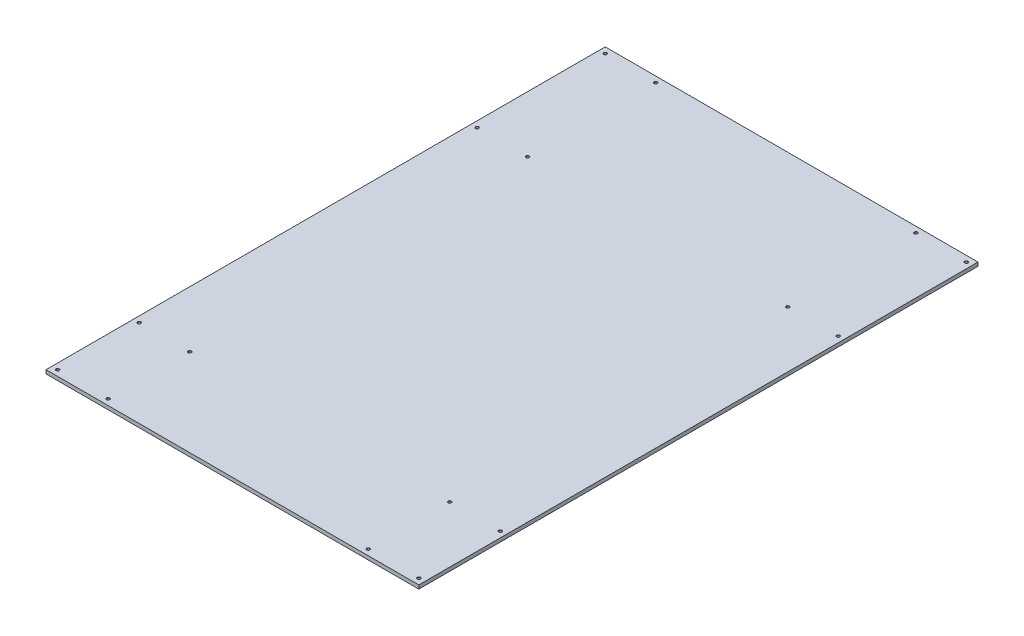
ISO-10303-21;
HEADER;
FILE_DESCRIPTION(('STEP AP214'),'2;1');
FILE_NAME('part.step','',(''),(''),'','','');
FILE_SCHEMA(('AUTOMOTIVE_DESIGN { 1 0 10303 214 1 1 1 1 }'));
ENDSEC;
DATA;
#1=APPLICATION_CONTEXT('core data for automotive mechanical design processes');
#2=APPLICATION_PROTOCOL_DEFINITION('international standard','automotive_design',2000,#1);
#3=PRODUCT_CONTEXT('',#1,'mechanical');
#4=PRODUCT('Part','Part','',(#3));
#5=PRODUCT_RELATED_PRODUCT_CATEGORY('part','',(#4));
#6=PRODUCT_DEFINITION_FORMATION('','',#4);
#7=PRODUCT_DEFINITION_CONTEXT('part definition',#1,'design');
#8=PRODUCT_DEFINITION('design','',#6,#7);
#9=PRODUCT_DEFINITION_SHAPE('','',#8);
#10=(LENGTH_UNIT() NAMED_UNIT(*) SI_UNIT(.MILLI.,.METRE.));
#11=(NAMED_UNIT(*) PLANE_ANGLE_UNIT() SI_UNIT($,.RADIAN.));
#12=(NAMED_UNIT(*) SI_UNIT($,.STERADIAN.) SOLID_ANGLE_UNIT());
#13=UNCERTAINTY_MEASURE_WITH_UNIT(LENGTH_MEASURE(1.E-05),#10,'distance_accuracy_value','');
#14=(GEOMETRIC_REPRESENTATION_CONTEXT(3) GLOBAL_UNCERTAINTY_ASSIGNED_CONTEXT((#13)) GLOBAL_UNIT_ASSIGNED_CONTEXT((#10,
#11,#12)) REPRESENTATION_CONTEXT('',''));
#15=CARTESIAN_POINT('',(0.,0.,0.));
#16=DIRECTION('',(0.,0.,1.));
#17=DIRECTION('',(1.,0.,0.));
#18=AXIS2_PLACEMENT_3D('',#15,#16,#17);
#19=CARTESIAN_POINT('',(0.,0.,0.));
#20=DIRECTION('',(0.,-1.,0.));
#21=DIRECTION('',(0.,0.,-1.));
#22=AXIS2_PLACEMENT_3D('',#19,#20,#21);
#23=PLANE('',#22);
#24=CARTESIAN_POINT('',(590.55,0.,-895.35));
#25=DIRECTION('',(0.,1.,0.));
#26=DIRECTION('',(0.,0.,1.));
#27=AXIS2_PLACEMENT_3D('',#24,#25,#26);
#28=CIRCLE('',#27,5.19912600000005);
#29=CARTESIAN_POINT('',(590.55,0.,-890.150874));
#30=VERTEX_POINT('',#29);
#31=EDGE_CURVE('E151',#30,#30,#28,.T.);
#32=ORIENTED_EDGE('',*,*,#31,.F.);
#33=EDGE_LOOP('',(#32));
#34=FACE_BOUND('',#33,.T.);
#35=CARTESIAN_POINT('',(425.45,0.,-895.35));
#36=DIRECTION('',(0.,1.,0.));
#37=DIRECTION('',(0.,0.,1.));
#38=AXIS2_PLACEMENT_3D('',#35,#36,#37);
#39=CIRCLE('',#38,5.199126);
#40=CARTESIAN_POINT('',(425.45,0.,-890.150874));
#41=VERTEX_POINT('',#40);
#42=EDGE_CURVE('E144',#41,#41,#39,.T.);
#43=ORIENTED_EDGE('',*,*,#42,.F.);
#44=EDGE_LOOP('',(#43));
#45=FACE_BOUND('',#44,.T.);
#46=CARTESIAN_POINT('',(590.55,0.,-476.25));
#47=DIRECTION('',(0.,1.,0.));
#48=DIRECTION('',(0.,0.,1.));
#49=AXIS2_PLACEMENT_3D('',#46,#47,#48);
#50=CIRCLE('',#49,5.19912600000005);
#51=CARTESIAN_POINT('',(590.55,0.,-471.050874));
#52=VERTEX_POINT('',#51);
#53=EDGE_CURVE('E169',#52,#52,#50,.T.);
#54=ORIENTED_EDGE('',*,*,#53,.F.);
#55=EDGE_LOOP('',(#54));
#56=FACE_BOUND('',#55,.T.);
#57=CARTESIAN_POINT('',(590.55,0.,628.65));
#58=DIRECTION('',(0.,1.,0.));
#59=DIRECTION('',(0.,0.,1.));
#60=AXIS2_PLACEMENT_3D('',#57,#58,#59);
#61=CIRCLE('',#60,5.19912600000005);
#62=CARTESIAN_POINT('',(590.55,0.,633.849126));
#63=VERTEX_POINT('',#62);
#64=EDGE_CURVE('E178',#63,#63,#61,.T.);
#65=ORIENTED_EDGE('',*,*,#64,.F.);
#66=EDGE_LOOP('',(#65));
#67=FACE_BOUND('',#66,.T.);
#68=CARTESIAN_POINT('',(425.45,0.,628.65));
#69=DIRECTION('',(0.,1.,0.));
#70=DIRECTION('',(0.,0.,1.));
#71=AXIS2_PLACEMENT_3D('',#68,#69,#70);
#72=CIRCLE('',#71,5.199126);
#73=CARTESIAN_POINT('',(425.45,0.,633.849126));
#74=VERTEX_POINT('',#73);
#75=EDGE_CURVE('E187',#74,#74,#72,.T.);
#76=ORIENTED_EDGE('',*,*,#75,.F.);
#77=EDGE_LOOP('',(#76));
#78=FACE_BOUND('',#77,.T.);
#79=CARTESIAN_POINT('',(425.45,0.,895.35));
#80=DIRECTION('',(0.,1.,0.));
#81=DIRECTION('',(0.,0.,1.));
#82=AXIS2_PLACEMENT_3D('',#79,#80,#81);
#83=CIRCLE('',#82,5.199126);
#84=CARTESIAN_POINT('',(425.45,0.,900.549126));
#85=VERTEX_POINT('',#84);
#86=EDGE_CURVE('E196',#85,#85,#83,.T.);
#87=ORIENTED_EDGE('',*,*,#86,.F.);
#88=EDGE_LOOP('',(#87));
#89=FACE_BOUND('',#88,.T.);
#90=CARTESIAN_POINT('',(590.55,0.,895.35));
#91=DIRECTION('',(0.,1.,0.));
#92=DIRECTION('',(0.,0.,1.));
#93=AXIS2_PLACEMENT_3D('',#90,#91,#92);
#94=CIRCLE('',#93,5.19912600000005);
#95=CARTESIAN_POINT('',(590.55,0.,900.549126));
#96=VERTEX_POINT('',#95);
#97=EDGE_CURVE('E205',#96,#96,#94,.T.);
#98=ORIENTED_EDGE('',*,*,#97,.F.);
#99=EDGE_LOOP('',(#98));
#100=FACE_BOUND('',#99,.T.);
#101=CARTESIAN_POINT('',(-590.55,0.,-895.35));
#102=DIRECTION('',(0.,1.,0.));
#103=DIRECTION('',(0.,0.,1.));
#104=AXIS2_PLACEMENT_3D('',#101,#102,#103);
#105=CIRCLE('',#104,5.19912600000005);
#106=CARTESIAN_POINT('',(-590.55,0.,-890.150874));
#107=VERTEX_POINT('',#106);
#108=EDGE_CURVE('E214',#107,#107,#105,.T.);
#109=ORIENTED_EDGE('',*,*,#108,.F.);
#110=EDGE_LOOP('',(#109));
#111=FACE_BOUND('',#110,.T.);
#112=CARTESIAN_POINT('',(-425.45,0.,-895.35));
#113=DIRECTION('',(0.,1.,0.));
#114=DIRECTION('',(0.,0.,1.));
#115=AXIS2_PLACEMENT_3D('',#112,#113,#114);
#116=CIRCLE('',#115,5.199126);
#117=CARTESIAN_POINT('',(-425.45,0.,-890.150874));
#118=VERTEX_POINT('',#117);
#119=EDGE_CURVE('E223',#118,#118,#116,.T.);
#120=ORIENTED_EDGE('',*,*,#119,.F.);
#121=EDGE_LOOP('',(#120));
#122=FACE_BOUND('',#121,.T.);
#123=CARTESIAN_POINT('',(-425.45,0.,-476.25));
#124=DIRECTION('',(0.,1.,0.));
#125=DIRECTION('',(0.,0.,1.));
#126=AXIS2_PLACEMENT_3D('',#123,#124,#125);
#127=CIRCLE('',#126,5.199126);
#128=CARTESIAN_POINT('',(-425.45,0.,-471.050874));
#129=VERTEX_POINT('',#128);
#130=EDGE_CURVE('E232',#129,#129,#127,.T.);
#131=ORIENTED_EDGE('',*,*,#130,.F.);
#132=EDGE_LOOP('',(#131));
#133=FACE_BOUND('',#132,.T.);
#134=CARTESIAN_POINT('',(-590.55,0.,-476.25));
#135=DIRECTION('',(0.,1.,0.));
#136=DIRECTION('',(0.,0.,1.));
#137=AXIS2_PLACEMENT_3D('',#134,#135,#136);
#138=CIRCLE('',#137,5.19912600000005);
#139=CARTESIAN_POINT('',(-590.55,0.,-471.050874));
#140=VERTEX_POINT('',#139);
#141=EDGE_CURVE('E241',#140,#140,#138,.T.);
#142=ORIENTED_EDGE('',*,*,#141,.F.);
#143=EDGE_LOOP('',(#142));
#144=FACE_BOUND('',#143,.T.);
#145=CARTESIAN_POINT('',(-590.55,0.,628.65));
#146=DIRECTION('',(0.,1.,0.));
#147=DIRECTION('',(0.,0.,1.));
#148=AXIS2_PLACEMENT_3D('',#145,#146,#147);
#149=CIRCLE('',#148,5.19912600000005);
#150=CARTESIAN_POINT('',(-590.55,0.,633.849126));
#151=VERTEX_POINT('',#150);
#152=EDGE_CURVE('E250',#151,#151,#149,.T.);
#153=ORIENTED_EDGE('',*,*,#152,.F.);
#154=EDGE_LOOP('',(#153));
#155=FACE_BOUND('',#154,.T.);
#156=CARTESIAN_POINT('',(-425.45,0.,895.35));
#157=DIRECTION('',(0.,1.,0.));
#158=DIRECTION('',(0.,0.,1.));
#159=AXIS2_PLACEMENT_3D('',#156,#157,#158);
#160=CIRCLE('',#159,5.199126);
#161=CARTESIAN_POINT('',(-425.45,0.,900.549126));
#162=VERTEX_POINT('',#161);
#163=EDGE_CURVE('E268',#162,#162,#160,.T.);
#164=ORIENTED_EDGE('',*,*,#163,.F.);
#165=EDGE_LOOP('',(#164));
#166=FACE_BOUND('',#165,.T.);
#167=CARTESIAN_POINT('',(-590.55,0.,895.35));
#168=DIRECTION('',(0.,1.,0.));
#169=DIRECTION('',(0.,0.,1.));
#170=AXIS2_PLACEMENT_3D('',#167,#168,#169);
#171=CIRCLE('',#170,5.19912600000005);
#172=CARTESIAN_POINT('',(-590.55,0.,900.549126));
#173=VERTEX_POINT('',#172);
#174=EDGE_CURVE('E277',#173,#173,#171,.T.);
#175=ORIENTED_EDGE('',*,*,#174,.F.);
#176=EDGE_LOOP('',(#175));
#177=FACE_BOUND('',#176,.T.);
#178=DIRECTION('',(0.,0.,-1.));
#179=VECTOR('',#178,1.);
#180=CARTESIAN_POINT('',(609.6,0.,914.4));
#181=LINE('',#180,#179);
#182=CARTESIAN_POINT('',(609.6,0.,914.4));
#183=VERTEX_POINT('',#182);
#184=CARTESIAN_POINT('',(609.6,0.,-914.4));
#185=VERTEX_POINT('',#184);
#186=EDGE_CURVE('E286',#183,#185,#181,.T.);
#187=ORIENTED_EDGE('',*,*,#186,.T.);
#188=DIRECTION('',(-1.,0.,0.));
#189=VECTOR('',#188,1.);
#190=CARTESIAN_POINT('',(-609.6,0.,-914.4));
#191=LINE('',#190,#189);
#192=CARTESIAN_POINT('',(-609.6,0.,-914.4));
#193=VERTEX_POINT('',#192);
#194=EDGE_CURVE('E298',#185,#193,#191,.T.);
#195=ORIENTED_EDGE('',*,*,#194,.T.);
#196=DIRECTION('',(0.,0.,1.));
#197=VECTOR('',#196,1.);
#198=CARTESIAN_POINT('',(-609.6,0.,914.4));
#199=LINE('',#198,#197);
#200=CARTESIAN_POINT('',(-609.6,0.,914.4));
#201=VERTEX_POINT('',#200);
#202=EDGE_CURVE('E301',#193,#201,#199,.T.);
#203=ORIENTED_EDGE('',*,*,#202,.T.);
#204=DIRECTION('',(1.,0.,0.));
#205=VECTOR('',#204,1.);
#206=CARTESIAN_POINT('',(-609.6,0.,914.4));
#207=LINE('',#206,#205);
#208=EDGE_CURVE('E290',#201,#183,#207,.T.);
#209=ORIENTED_EDGE('',*,*,#208,.T.);
#210=EDGE_LOOP('',(#187,#195,#203,#209));
#211=FACE_BOUND('',#210,.T.);
#212=CARTESIAN_POINT('',(-425.45,0.,628.65));
#213=DIRECTION('',(0.,1.,0.));
#214=DIRECTION('',(0.,0.,1.));
#215=AXIS2_PLACEMENT_3D('',#212,#213,#214);
#216=CIRCLE('',#215,5.199126);
#217=CARTESIAN_POINT('',(-425.45,0.,633.849126));
#218=VERTEX_POINT('',#217);
#219=EDGE_CURVE('E259',#218,#218,#216,.T.);
#220=ORIENTED_EDGE('',*,*,#219,.F.);
#221=EDGE_LOOP('',(#220));
#222=FACE_BOUND('',#221,.T.);
#223=CARTESIAN_POINT('',(425.45,0.,-476.25));
#224=DIRECTION('',(0.,1.,0.));
#225=DIRECTION('',(0.,0.,1.));
#226=AXIS2_PLACEMENT_3D('',#223,#224,#225);
#227=CIRCLE('',#226,5.199126);
#228=CARTESIAN_POINT('',(425.45,0.,-471.050874));
#229=VERTEX_POINT('',#228);
#230=EDGE_CURVE('E160',#229,#229,#227,.T.);
#231=ORIENTED_EDGE('',*,*,#230,.F.);
#232=EDGE_LOOP('',(#231));
#233=FACE_BOUND('',#232,.T.);
#234=ADVANCED_FACE('F39',(#34,#45,#56,#67,#78,#89,#100,#111,#122,#133,#144,#155,#166,#177,#211,
#222,#233),#23,.F.);
#235=CARTESIAN_POINT('',(609.6,-12.,914.4));
#236=DIRECTION('',(1.,0.,0.));
#237=DIRECTION('',(0.,0.,-1.));
#238=AXIS2_PLACEMENT_3D('',#235,#236,#237);
#239=PLANE('',#238);
#240=ORIENTED_EDGE('',*,*,#186,.F.);
#241=DIRECTION('',(0.,1.,0.));
#242=VECTOR('',#241,1.);
#243=CARTESIAN_POINT('',(609.6,-12.,914.4));
#244=LINE('',#243,#242);
#245=CARTESIAN_POINT('',(609.6,-12.,914.4));
#246=VERTEX_POINT('',#245);
#247=EDGE_CURVE('E11',#246,#183,#244,.T.);
#248=ORIENTED_EDGE('',*,*,#247,.F.);
#249=DIRECTION('',(0.,0.,-1.));
#250=VECTOR('',#249,1.);
#251=CARTESIAN_POINT('',(609.6,-12.,914.4));
#252=LINE('',#251,#250);
#253=CARTESIAN_POINT('',(609.6,-12.,-914.4));
#254=VERTEX_POINT('',#253);
#255=EDGE_CURVE('E287',#246,#254,#252,.T.);
#256=ORIENTED_EDGE('',*,*,#255,.T.);
#257=DIRECTION('',(0.,1.,0.));
#258=VECTOR('',#257,1.);
#259=CARTESIAN_POINT('',(609.6,-12.,-914.4));
#260=LINE('',#259,#258);
#261=EDGE_CURVE('E43',#254,#185,#260,.T.);
#262=ORIENTED_EDGE('',*,*,#261,.T.);
#263=EDGE_LOOP('',(#240,#248,#256,#262));
#264=FACE_BOUND('',#263,.T.);
#265=ADVANCED_FACE('F41',(#264),#239,.T.);
#266=CARTESIAN_POINT('',(-609.6,-12.,914.4));
#267=DIRECTION('',(0.,0.,1.));
#268=DIRECTION('',(1.,0.,0.));
#269=AXIS2_PLACEMENT_3D('',#266,#267,#268);
#270=PLANE('',#269);
#271=ORIENTED_EDGE('',*,*,#208,.F.);
#272=DIRECTION('',(0.,1.,0.));
#273=VECTOR('',#272,1.);
#274=CARTESIAN_POINT('',(-609.6,-12.,914.4));
#275=LINE('',#274,#273);
#276=CARTESIAN_POINT('',(-609.6,-12.,914.4));
#277=VERTEX_POINT('',#276);
#278=EDGE_CURVE('E49',#277,#201,#275,.T.);
#279=ORIENTED_EDGE('',*,*,#278,.F.);
#280=DIRECTION('',(1.,0.,0.));
#281=VECTOR('',#280,1.);
#282=CARTESIAN_POINT('',(-609.6,-12.,914.4));
#283=LINE('',#282,#281);
#284=EDGE_CURVE('E294',#277,#246,#283,.T.);
#285=ORIENTED_EDGE('',*,*,#284,.T.);
#286=ORIENTED_EDGE('',*,*,#247,.T.);
#287=EDGE_LOOP('',(#271,#279,#285,#286));
#288=FACE_BOUND('',#287,.T.);
#289=ADVANCED_FACE('F309',(#288),#270,.T.);
#290=CARTESIAN_POINT('',(-609.6,-12.,914.4));
#291=DIRECTION('',(-1.,0.,0.));
#292=DIRECTION('',(0.,0.,1.));
#293=AXIS2_PLACEMENT_3D('',#290,#291,#292);
#294=PLANE('',#293);
#295=ORIENTED_EDGE('',*,*,#202,.F.);
#296=DIRECTION('',(0.,1.,0.));
#297=VECTOR('',#296,1.);
#298=CARTESIAN_POINT('',(-609.6,-12.,-914.4));
#299=LINE('',#298,#297);
#300=CARTESIAN_POINT('',(-609.6,-12.,-914.4));
#301=VERTEX_POINT('',#300);
#302=EDGE_CURVE('E305',#301,#193,#299,.T.);
#303=ORIENTED_EDGE('',*,*,#302,.F.);
#304=DIRECTION('',(0.,0.,1.));
#305=VECTOR('',#304,1.);
#306=CARTESIAN_POINT('',(-609.6,-12.,914.4));
#307=LINE('',#306,#305);
#308=EDGE_CURVE('E292',#301,#277,#307,.T.);
#309=ORIENTED_EDGE('',*,*,#308,.T.);
#310=ORIENTED_EDGE('',*,*,#278,.T.);
#311=EDGE_LOOP('',(#295,#303,#309,#310));
#312=FACE_BOUND('',#311,.T.);
#313=ADVANCED_FACE('F312',(#312),#294,.T.);
#314=CARTESIAN_POINT('',(-609.6,-12.,-914.4));
#315=DIRECTION('',(0.,0.,-1.));
#316=DIRECTION('',(-1.,0.,0.));
#317=AXIS2_PLACEMENT_3D('',#314,#315,#316);
#318=PLANE('',#317);
#319=ORIENTED_EDGE('',*,*,#194,.F.);
#320=ORIENTED_EDGE('',*,*,#261,.F.);
#321=DIRECTION('',(-1.,0.,0.));
#322=VECTOR('',#321,1.);
#323=CARTESIAN_POINT('',(-609.6,-12.,-914.4));
#324=LINE('',#323,#322);
#325=EDGE_CURVE('E289',#254,#301,#324,.T.);
#326=ORIENTED_EDGE('',*,*,#325,.T.);
#327=ORIENTED_EDGE('',*,*,#302,.T.);
#328=EDGE_LOOP('',(#319,#320,#326,#327));
#329=FACE_BOUND('',#328,.T.);
#330=ADVANCED_FACE('F306',(#329),#318,.T.);
#331=CARTESIAN_POINT('',(0.,-12.,0.));
#332=DIRECTION('',(0.,-1.,0.));
#333=DIRECTION('',(0.,0.,-1.));
#334=AXIS2_PLACEMENT_3D('',#331,#332,#333);
#335=PLANE('',#334);
#336=ORIENTED_EDGE('',*,*,#255,.F.);
#337=ORIENTED_EDGE('',*,*,#284,.F.);
#338=ORIENTED_EDGE('',*,*,#308,.F.);
#339=ORIENTED_EDGE('',*,*,#325,.F.);
#340=EDGE_LOOP('',(#336,#337,#338,#339));
#341=FACE_BOUND('',#340,.T.);
#342=ADVANCED_FACE('F314',(#341),#335,.T.);
#343=CARTESIAN_POINT('',(-590.55,-7.17947142632021,895.35));
#344=DIRECTION('',(0.,1.,0.));
#345=DIRECTION('',(0.,0.,1.));
#346=AXIS2_PLACEMENT_3D('',#343,#344,#345);
#347=CONICAL_SURFACE('',#346,4.564126,1.02974425867665);
#348=CARTESIAN_POINT('',(-590.55,-9.921875,895.35));
#349=VERTEX_POINT('',#348);
#350=VERTEX_LOOP('',#349);
#351=FACE_BOUND('',#350,.T.);
#352=CARTESIAN_POINT('',(-590.55,-7.17947142632021,895.35));
#353=DIRECTION('',(0.,1.,0.));
#354=DIRECTION('',(0.,0.,1.));
#355=AXIS2_PLACEMENT_3D('',#352,#353,#354);
#356=CIRCLE('',#355,4.564126);
#357=CARTESIAN_POINT('',(-590.55,-7.17947142632021,899.914126));
#358=VERTEX_POINT('',#357);
#359=EDGE_CURVE('E283',#358,#358,#356,.T.);
#360=ORIENTED_EDGE('',*,*,#359,.T.);
#361=EDGE_LOOP('',(#360));
#362=FACE_BOUND('',#361,.T.);
#363=ADVANCED_FACE('F316',(#351,#362),#347,.F.);
#364=CARTESIAN_POINT('',(-590.55,0.,895.35));
#365=DIRECTION('',(0.,1.,0.));
#366=DIRECTION('',(0.,0.,1.));
#367=AXIS2_PLACEMENT_3D('',#364,#365,#366);
#368=CYLINDRICAL_SURFACE('',#367,4.564126);
#369=ORIENTED_EDGE('',*,*,#359,.F.);
#370=EDGE_LOOP('',(#369));
#371=FACE_BOUND('',#370,.T.);
#372=CARTESIAN_POINT('',(-590.55,-0.634999999999998,895.35));
#373=DIRECTION('',(0.,1.,0.));
#374=DIRECTION('',(0.,0.,1.));
#375=AXIS2_PLACEMENT_3D('',#372,#373,#374);
#376=CIRCLE('',#375,4.564126);
#377=CARTESIAN_POINT('',(-590.55,-0.634999999999998,899.914126));
#378=VERTEX_POINT('',#377);
#379=EDGE_CURVE('E280',#378,#378,#376,.T.);
#380=ORIENTED_EDGE('',*,*,#379,.T.);
#381=EDGE_LOOP('',(#380));
#382=FACE_BOUND('',#381,.T.);
#383=ADVANCED_FACE('F322',(#371,#382),#368,.F.);
#384=CARTESIAN_POINT('',(-590.55,0.,895.35));
#385=DIRECTION('',(0.,1.,0.));
#386=DIRECTION('',(0.,0.,1.));
#387=AXIS2_PLACEMENT_3D('',#384,#385,#386);
#388=CONICAL_SURFACE('',#387,5.19912600000005,0.785398163397491);
#389=ORIENTED_EDGE('',*,*,#379,.F.);
#390=EDGE_LOOP('',(#389));
#391=FACE_BOUND('',#390,.T.);
#392=ORIENTED_EDGE('',*,*,#174,.T.);
#393=EDGE_LOOP('',(#392));
#394=FACE_BOUND('',#393,.T.);
#395=ADVANCED_FACE('F368',(#391,#394),#388,.F.);
#396=CARTESIAN_POINT('',(-425.45,-7.17947142632021,895.35));
#397=DIRECTION('',(0.,1.,0.));
#398=DIRECTION('',(0.,0.,1.));
#399=AXIS2_PLACEMENT_3D('',#396,#397,#398);
#400=CONICAL_SURFACE('',#399,4.564126,1.02974425867665);
#401=CARTESIAN_POINT('',(-425.45,-9.921875,895.35));
#402=VERTEX_POINT('',#401);
#403=VERTEX_LOOP('',#402);
#404=FACE_BOUND('',#403,.T.);
#405=CARTESIAN_POINT('',(-425.45,-7.17947142632021,895.35));
#406=DIRECTION('',(0.,1.,0.));
#407=DIRECTION('',(0.,0.,1.));
#408=AXIS2_PLACEMENT_3D('',#405,#406,#407);
#409=CIRCLE('',#408,4.564126);
#410=CARTESIAN_POINT('',(-425.45,-7.17947142632021,899.914126));
#411=VERTEX_POINT('',#410);
#412=EDGE_CURVE('E274',#411,#411,#409,.T.);
#413=ORIENTED_EDGE('',*,*,#412,.T.);
#414=EDGE_LOOP('',(#413));
#415=FACE_BOUND('',#414,.T.);
#416=ADVANCED_FACE('F378',(#404,#415),#400,.F.);
#417=CARTESIAN_POINT('',(-425.45,0.,895.35));
#418=DIRECTION('',(0.,1.,0.));
#419=DIRECTION('',(0.,0.,1.));
#420=AXIS2_PLACEMENT_3D('',#417,#418,#419);
#421=CYLINDRICAL_SURFACE('',#420,4.564126);
#422=ORIENTED_EDGE('',*,*,#412,.F.);
#423=EDGE_LOOP('',(#422));
#424=FACE_BOUND('',#423,.T.);
#425=CARTESIAN_POINT('',(-425.45,-0.634999999999998,895.35));
#426=DIRECTION('',(0.,1.,0.));
#427=DIRECTION('',(0.,0.,1.));
#428=AXIS2_PLACEMENT_3D('',#425,#426,#427);
#429=CIRCLE('',#428,4.564126);
#430=CARTESIAN_POINT('',(-425.45,-0.634999999999998,899.914126));
#431=VERTEX_POINT('',#430);
#432=EDGE_CURVE('E271',#431,#431,#429,.T.);
#433=ORIENTED_EDGE('',*,*,#432,.T.);
#434=EDGE_LOOP('',(#433));
#435=FACE_BOUND('',#434,.T.);
#436=ADVANCED_FACE('F388',(#424,#435),#421,.F.);
#437=CARTESIAN_POINT('',(-425.45,0.,895.35));
#438=DIRECTION('',(0.,1.,0.));
#439=DIRECTION('',(0.,0.,1.));
#440=AXIS2_PLACEMENT_3D('',#437,#438,#439);
#441=CONICAL_SURFACE('',#440,5.199126,0.785398163397447);
#442=ORIENTED_EDGE('',*,*,#432,.F.);
#443=EDGE_LOOP('',(#442));
#444=FACE_BOUND('',#443,.T.);
#445=ORIENTED_EDGE('',*,*,#163,.T.);
#446=EDGE_LOOP('',(#445));
#447=FACE_BOUND('',#446,.T.);
#448=ADVANCED_FACE('F398',(#444,#447),#441,.F.);
#449=CARTESIAN_POINT('',(-425.45,-7.17947142632021,628.65));
#450=DIRECTION('',(0.,1.,0.));
#451=DIRECTION('',(0.,0.,1.));
#452=AXIS2_PLACEMENT_3D('',#449,#450,#451);
#453=CONICAL_SURFACE('',#452,4.564126,1.02974425867665);
#454=CARTESIAN_POINT('',(-425.45,-9.921875,628.65));
#455=VERTEX_POINT('',#454);
#456=VERTEX_LOOP('',#455);
#457=FACE_BOUND('',#456,.T.);
#458=CARTESIAN_POINT('',(-425.45,-7.17947142632021,628.65));
#459=DIRECTION('',(0.,1.,0.));
#460=DIRECTION('',(0.,0.,1.));
#461=AXIS2_PLACEMENT_3D('',#458,#459,#460);
#462=CIRCLE('',#461,4.564126);
#463=CARTESIAN_POINT('',(-425.45,-7.17947142632021,633.214126));
#464=VERTEX_POINT('',#463);
#465=EDGE_CURVE('E265',#464,#464,#462,.T.);
#466=ORIENTED_EDGE('',*,*,#465,.T.);
#467=EDGE_LOOP('',(#466));
#468=FACE_BOUND('',#467,.T.);
#469=ADVANCED_FACE('F408',(#457,#468),#453,.F.);
#470=CARTESIAN_POINT('',(-425.45,0.,628.65));
#471=DIRECTION('',(0.,1.,0.));
#472=DIRECTION('',(0.,0.,1.));
#473=AXIS2_PLACEMENT_3D('',#470,#471,#472);
#474=CYLINDRICAL_SURFACE('',#473,4.564126);
#475=ORIENTED_EDGE('',*,*,#465,.F.);
#476=EDGE_LOOP('',(#475));
#477=FACE_BOUND('',#476,.T.);
#478=CARTESIAN_POINT('',(-425.45,-0.634999999999998,628.65));
#479=DIRECTION('',(0.,1.,0.));
#480=DIRECTION('',(0.,0.,1.));
#481=AXIS2_PLACEMENT_3D('',#478,#479,#480);
#482=CIRCLE('',#481,4.564126);
#483=CARTESIAN_POINT('',(-425.45,-0.634999999999998,633.214126));
#484=VERTEX_POINT('',#483);
#485=EDGE_CURVE('E262',#484,#484,#482,.T.);
#486=ORIENTED_EDGE('',*,*,#485,.T.);
#487=EDGE_LOOP('',(#486));
#488=FACE_BOUND('',#487,.T.);
#489=ADVANCED_FACE('F418',(#477,#488),#474,.F.);
#490=CARTESIAN_POINT('',(-425.45,0.,628.65));
#491=DIRECTION('',(0.,1.,0.));
#492=DIRECTION('',(0.,0.,1.));
#493=AXIS2_PLACEMENT_3D('',#490,#491,#492);
#494=CONICAL_SURFACE('',#493,5.199126,0.785398163397447);
#495=ORIENTED_EDGE('',*,*,#485,.F.);
#496=EDGE_LOOP('',(#495));
#497=FACE_BOUND('',#496,.T.);
#498=ORIENTED_EDGE('',*,*,#219,.T.);
#499=EDGE_LOOP('',(#498));
#500=FACE_BOUND('',#499,.T.);
#501=ADVANCED_FACE('F428',(#497,#500),#494,.F.);
#502=CARTESIAN_POINT('',(-590.55,-7.17947142632021,628.65));
#503=DIRECTION('',(0.,1.,0.));
#504=DIRECTION('',(0.,0.,1.));
#505=AXIS2_PLACEMENT_3D('',#502,#503,#504);
#506=CONICAL_SURFACE('',#505,4.564126,1.02974425867665);
#507=CARTESIAN_POINT('',(-590.55,-9.921875,628.65));
#508=VERTEX_POINT('',#507);
#509=VERTEX_LOOP('',#508);
#510=FACE_BOUND('',#509,.T.);
#511=CARTESIAN_POINT('',(-590.55,-7.17947142632021,628.65));
#512=DIRECTION('',(0.,1.,0.));
#513=DIRECTION('',(0.,0.,1.));
#514=AXIS2_PLACEMENT_3D('',#511,#512,#513);
#515=CIRCLE('',#514,4.564126);
#516=CARTESIAN_POINT('',(-590.55,-7.17947142632021,633.214126));
#517=VERTEX_POINT('',#516);
#518=EDGE_CURVE('E256',#517,#517,#515,.T.);
#519=ORIENTED_EDGE('',*,*,#518,.T.);
#520=EDGE_LOOP('',(#519));
#521=FACE_BOUND('',#520,.T.);
#522=ADVANCED_FACE('F438',(#510,#521),#506,.F.);
#523=CARTESIAN_POINT('',(-590.55,0.,628.65));
#524=DIRECTION('',(0.,1.,0.));
#525=DIRECTION('',(0.,0.,1.));
#526=AXIS2_PLACEMENT_3D('',#523,#524,#525);
#527=CYLINDRICAL_SURFACE('',#526,4.564126);
#528=ORIENTED_EDGE('',*,*,#518,.F.);
#529=EDGE_LOOP('',(#528));
#530=FACE_BOUND('',#529,.T.);
#531=CARTESIAN_POINT('',(-590.55,-0.634999999999998,628.65));
#532=DIRECTION('',(0.,1.,0.));
#533=DIRECTION('',(0.,0.,1.));
#534=AXIS2_PLACEMENT_3D('',#531,#532,#533);
#535=CIRCLE('',#534,4.564126);
#536=CARTESIAN_POINT('',(-590.55,-0.634999999999998,633.214126));
#537=VERTEX_POINT('',#536);
#538=EDGE_CURVE('E253',#537,#537,#535,.T.);
#539=ORIENTED_EDGE('',*,*,#538,.T.);
#540=EDGE_LOOP('',(#539));
#541=FACE_BOUND('',#540,.T.);
#542=ADVANCED_FACE('F448',(#530,#541),#527,.F.);
#543=CARTESIAN_POINT('',(-590.55,0.,628.65));
#544=DIRECTION('',(0.,1.,0.));
#545=DIRECTION('',(0.,0.,1.));
#546=AXIS2_PLACEMENT_3D('',#543,#544,#545);
#547=CONICAL_SURFACE('',#546,5.19912600000005,0.785398163397491);
#548=ORIENTED_EDGE('',*,*,#538,.F.);
#549=EDGE_LOOP('',(#548));
#550=FACE_BOUND('',#549,.T.);
#551=ORIENTED_EDGE('',*,*,#152,.T.);
#552=EDGE_LOOP('',(#551));
#553=FACE_BOUND('',#552,.T.);
#554=ADVANCED_FACE('F458',(#550,#553),#547,.F.);
#555=CARTESIAN_POINT('',(-590.55,-7.17947142632021,-476.25));
#556=DIRECTION('',(0.,1.,0.));
#557=DIRECTION('',(0.,0.,1.));
#558=AXIS2_PLACEMENT_3D('',#555,#556,#557);
#559=CONICAL_SURFACE('',#558,4.564126,1.02974425867665);
#560=CARTESIAN_POINT('',(-590.55,-9.921875,-476.25));
#561=VERTEX_POINT('',#560);
#562=VERTEX_LOOP('',#561);
#563=FACE_BOUND('',#562,.T.);
#564=CARTESIAN_POINT('',(-590.55,-7.17947142632021,-476.25));
#565=DIRECTION('',(0.,1.,0.));
#566=DIRECTION('',(0.,0.,1.));
#567=AXIS2_PLACEMENT_3D('',#564,#565,#566);
#568=CIRCLE('',#567,4.564126);
#569=CARTESIAN_POINT('',(-590.55,-7.17947142632021,-471.685874));
#570=VERTEX_POINT('',#569);
#571=EDGE_CURVE('E247',#570,#570,#568,.T.);
#572=ORIENTED_EDGE('',*,*,#571,.T.);
#573=EDGE_LOOP('',(#572));
#574=FACE_BOUND('',#573,.T.);
#575=ADVANCED_FACE('F468',(#563,#574),#559,.F.);
#576=CARTESIAN_POINT('',(-590.55,0.,-476.25));
#577=DIRECTION('',(0.,1.,0.));
#578=DIRECTION('',(0.,0.,1.));
#579=AXIS2_PLACEMENT_3D('',#576,#577,#578);
#580=CYLINDRICAL_SURFACE('',#579,4.564126);
#581=ORIENTED_EDGE('',*,*,#571,.F.);
#582=EDGE_LOOP('',(#581));
#583=FACE_BOUND('',#582,.T.);
#584=CARTESIAN_POINT('',(-590.55,-0.634999999999998,-476.25));
#585=DIRECTION('',(0.,1.,0.));
#586=DIRECTION('',(0.,0.,1.));
#587=AXIS2_PLACEMENT_3D('',#584,#585,#586);
#588=CIRCLE('',#587,4.564126);
#589=CARTESIAN_POINT('',(-590.55,-0.634999999999998,-471.685874));
#590=VERTEX_POINT('',#589);
#591=EDGE_CURVE('E244',#590,#590,#588,.T.);
#592=ORIENTED_EDGE('',*,*,#591,.T.);
#593=EDGE_LOOP('',(#592));
#594=FACE_BOUND('',#593,.T.);
#595=ADVANCED_FACE('F478',(#583,#594),#580,.F.);
#596=CARTESIAN_POINT('',(-590.55,0.,-476.25));
#597=DIRECTION('',(0.,1.,0.));
#598=DIRECTION('',(0.,0.,1.));
#599=AXIS2_PLACEMENT_3D('',#596,#597,#598);
#600=CONICAL_SURFACE('',#599,5.19912600000005,0.785398163397491);
#601=ORIENTED_EDGE('',*,*,#591,.F.);
#602=EDGE_LOOP('',(#601));
#603=FACE_BOUND('',#602,.T.);
#604=ORIENTED_EDGE('',*,*,#141,.T.);
#605=EDGE_LOOP('',(#604));
#606=FACE_BOUND('',#605,.T.);
#607=ADVANCED_FACE('F488',(#603,#606),#600,.F.);
#608=CARTESIAN_POINT('',(-425.45,-7.17947142632021,-476.25));
#609=DIRECTION('',(0.,1.,0.));
#610=DIRECTION('',(0.,0.,1.));
#611=AXIS2_PLACEMENT_3D('',#608,#609,#610);
#612=CONICAL_SURFACE('',#611,4.564126,1.02974425867665);
#613=CARTESIAN_POINT('',(-425.45,-9.921875,-476.25));
#614=VERTEX_POINT('',#613);
#615=VERTEX_LOOP('',#614);
#616=FACE_BOUND('',#615,.T.);
#617=CARTESIAN_POINT('',(-425.45,-7.17947142632021,-476.25));
#618=DIRECTION('',(0.,1.,0.));
#619=DIRECTION('',(0.,0.,1.));
#620=AXIS2_PLACEMENT_3D('',#617,#618,#619);
#621=CIRCLE('',#620,4.564126);
#622=CARTESIAN_POINT('',(-425.45,-7.17947142632021,-471.685874));
#623=VERTEX_POINT('',#622);
#624=EDGE_CURVE('E238',#623,#623,#621,.T.);
#625=ORIENTED_EDGE('',*,*,#624,.T.);
#626=EDGE_LOOP('',(#625));
#627=FACE_BOUND('',#626,.T.);
#628=ADVANCED_FACE('F498',(#616,#627),#612,.F.);
#629=CARTESIAN_POINT('',(-425.45,0.,-476.25));
#630=DIRECTION('',(0.,1.,0.));
#631=DIRECTION('',(0.,0.,1.));
#632=AXIS2_PLACEMENT_3D('',#629,#630,#631);
#633=CYLINDRICAL_SURFACE('',#632,4.564126);
#634=ORIENTED_EDGE('',*,*,#624,.F.);
#635=EDGE_LOOP('',(#634));
#636=FACE_BOUND('',#635,.T.);
#637=CARTESIAN_POINT('',(-425.45,-0.634999999999998,-476.25));
#638=DIRECTION('',(0.,1.,0.));
#639=DIRECTION('',(0.,0.,1.));
#640=AXIS2_PLACEMENT_3D('',#637,#638,#639);
#641=CIRCLE('',#640,4.564126);
#642=CARTESIAN_POINT('',(-425.45,-0.634999999999998,-471.685874));
#643=VERTEX_POINT('',#642);
#644=EDGE_CURVE('E235',#643,#643,#641,.T.);
#645=ORIENTED_EDGE('',*,*,#644,.T.);
#646=EDGE_LOOP('',(#645));
#647=FACE_BOUND('',#646,.T.);
#648=ADVANCED_FACE('F508',(#636,#647),#633,.F.);
#649=CARTESIAN_POINT('',(-425.45,0.,-476.25));
#650=DIRECTION('',(0.,1.,0.));
#651=DIRECTION('',(0.,0.,1.));
#652=AXIS2_PLACEMENT_3D('',#649,#650,#651);
#653=CONICAL_SURFACE('',#652,5.199126,0.785398163397447);
#654=ORIENTED_EDGE('',*,*,#644,.F.);
#655=EDGE_LOOP('',(#654));
#656=FACE_BOUND('',#655,.T.);
#657=ORIENTED_EDGE('',*,*,#130,.T.);
#658=EDGE_LOOP('',(#657));
#659=FACE_BOUND('',#658,.T.);
#660=ADVANCED_FACE('F518',(#656,#659),#653,.F.);
#661=CARTESIAN_POINT('',(-425.45,-7.17947142632021,-895.35));
#662=DIRECTION('',(0.,1.,0.));
#663=DIRECTION('',(0.,0.,1.));
#664=AXIS2_PLACEMENT_3D('',#661,#662,#663);
#665=CONICAL_SURFACE('',#664,4.564126,1.02974425867665);
#666=CARTESIAN_POINT('',(-425.45,-9.921875,-895.35));
#667=VERTEX_POINT('',#666);
#668=VERTEX_LOOP('',#667);
#669=FACE_BOUND('',#668,.T.);
#670=CARTESIAN_POINT('',(-425.45,-7.17947142632021,-895.35));
#671=DIRECTION('',(0.,1.,0.));
#672=DIRECTION('',(0.,0.,1.));
#673=AXIS2_PLACEMENT_3D('',#670,#671,#672);
#674=CIRCLE('',#673,4.564126);
#675=CARTESIAN_POINT('',(-425.45,-7.17947142632021,-890.785874));
#676=VERTEX_POINT('',#675);
#677=EDGE_CURVE('E229',#676,#676,#674,.T.);
#678=ORIENTED_EDGE('',*,*,#677,.T.);
#679=EDGE_LOOP('',(#678));
#680=FACE_BOUND('',#679,.T.);
#681=ADVANCED_FACE('F528',(#669,#680),#665,.F.);
#682=CARTESIAN_POINT('',(-425.45,0.,-895.35));
#683=DIRECTION('',(0.,1.,0.));
#684=DIRECTION('',(0.,0.,1.));
#685=AXIS2_PLACEMENT_3D('',#682,#683,#684);
#686=CYLINDRICAL_SURFACE('',#685,4.564126);
#687=ORIENTED_EDGE('',*,*,#677,.F.);
#688=EDGE_LOOP('',(#687));
#689=FACE_BOUND('',#688,.T.);
#690=CARTESIAN_POINT('',(-425.45,-0.634999999999998,-895.35));
#691=DIRECTION('',(0.,1.,0.));
#692=DIRECTION('',(0.,0.,1.));
#693=AXIS2_PLACEMENT_3D('',#690,#691,#692);
#694=CIRCLE('',#693,4.564126);
#695=CARTESIAN_POINT('',(-425.45,-0.634999999999998,-890.785874));
#696=VERTEX_POINT('',#695);
#697=EDGE_CURVE('E226',#696,#696,#694,.T.);
#698=ORIENTED_EDGE('',*,*,#697,.T.);
#699=EDGE_LOOP('',(#698));
#700=FACE_BOUND('',#699,.T.);
#701=ADVANCED_FACE('F538',(#689,#700),#686,.F.);
#702=CARTESIAN_POINT('',(-425.45,0.,-895.35));
#703=DIRECTION('',(0.,1.,0.));
#704=DIRECTION('',(0.,0.,1.));
#705=AXIS2_PLACEMENT_3D('',#702,#703,#704);
#706=CONICAL_SURFACE('',#705,5.199126,0.785398163397447);
#707=ORIENTED_EDGE('',*,*,#697,.F.);
#708=EDGE_LOOP('',(#707));
#709=FACE_BOUND('',#708,.T.);
#710=ORIENTED_EDGE('',*,*,#119,.T.);
#711=EDGE_LOOP('',(#710));
#712=FACE_BOUND('',#711,.T.);
#713=ADVANCED_FACE('F548',(#709,#712),#706,.F.);
#714=CARTESIAN_POINT('',(-590.55,-7.17947142632021,-895.35));
#715=DIRECTION('',(0.,1.,0.));
#716=DIRECTION('',(0.,0.,1.));
#717=AXIS2_PLACEMENT_3D('',#714,#715,#716);
#718=CONICAL_SURFACE('',#717,4.564126,1.02974425867665);
#719=CARTESIAN_POINT('',(-590.55,-9.921875,-895.35));
#720=VERTEX_POINT('',#719);
#721=VERTEX_LOOP('',#720);
#722=FACE_BOUND('',#721,.T.);
#723=CARTESIAN_POINT('',(-590.55,-7.17947142632021,-895.35));
#724=DIRECTION('',(0.,1.,0.));
#725=DIRECTION('',(0.,0.,1.));
#726=AXIS2_PLACEMENT_3D('',#723,#724,#725);
#727=CIRCLE('',#726,4.564126);
#728=CARTESIAN_POINT('',(-590.55,-7.17947142632021,-890.785874));
#729=VERTEX_POINT('',#728);
#730=EDGE_CURVE('E220',#729,#729,#727,.T.);
#731=ORIENTED_EDGE('',*,*,#730,.T.);
#732=EDGE_LOOP('',(#731));
#733=FACE_BOUND('',#732,.T.);
#734=ADVANCED_FACE('F558',(#722,#733),#718,.F.);
#735=CARTESIAN_POINT('',(-590.55,0.,-895.35));
#736=DIRECTION('',(0.,1.,0.));
#737=DIRECTION('',(0.,0.,1.));
#738=AXIS2_PLACEMENT_3D('',#735,#736,#737);
#739=CYLINDRICAL_SURFACE('',#738,4.564126);
#740=ORIENTED_EDGE('',*,*,#730,.F.);
#741=EDGE_LOOP('',(#740));
#742=FACE_BOUND('',#741,.T.);
#743=CARTESIAN_POINT('',(-590.55,-0.634999999999998,-895.35));
#744=DIRECTION('',(0.,1.,0.));
#745=DIRECTION('',(0.,0.,1.));
#746=AXIS2_PLACEMENT_3D('',#743,#744,#745);
#747=CIRCLE('',#746,4.564126);
#748=CARTESIAN_POINT('',(-590.55,-0.634999999999998,-890.785874));
#749=VERTEX_POINT('',#748);
#750=EDGE_CURVE('E217',#749,#749,#747,.T.);
#751=ORIENTED_EDGE('',*,*,#750,.T.);
#752=EDGE_LOOP('',(#751));
#753=FACE_BOUND('',#752,.T.);
#754=ADVANCED_FACE('F568',(#742,#753),#739,.F.);
#755=CARTESIAN_POINT('',(-590.55,0.,-895.35));
#756=DIRECTION('',(0.,1.,0.));
#757=DIRECTION('',(0.,0.,1.));
#758=AXIS2_PLACEMENT_3D('',#755,#756,#757);
#759=CONICAL_SURFACE('',#758,5.19912600000005,0.785398163397491);
#760=ORIENTED_EDGE('',*,*,#750,.F.);
#761=EDGE_LOOP('',(#760));
#762=FACE_BOUND('',#761,.T.);
#763=ORIENTED_EDGE('',*,*,#108,.T.);
#764=EDGE_LOOP('',(#763));
#765=FACE_BOUND('',#764,.T.);
#766=ADVANCED_FACE('F578',(#762,#765),#759,.F.);
#767=CARTESIAN_POINT('',(590.55,-7.17947142632021,895.35));
#768=DIRECTION('',(0.,1.,0.));
#769=DIRECTION('',(0.,0.,1.));
#770=AXIS2_PLACEMENT_3D('',#767,#768,#769);
#771=CONICAL_SURFACE('',#770,4.564126,1.02974425867665);
#772=CARTESIAN_POINT('',(590.55,-9.921875,895.35));
#773=VERTEX_POINT('',#772);
#774=VERTEX_LOOP('',#773);
#775=FACE_BOUND('',#774,.T.);
#776=CARTESIAN_POINT('',(590.55,-7.17947142632021,895.35));
#777=DIRECTION('',(0.,1.,0.));
#778=DIRECTION('',(0.,0.,1.));
#779=AXIS2_PLACEMENT_3D('',#776,#777,#778);
#780=CIRCLE('',#779,4.564126);
#781=CARTESIAN_POINT('',(590.55,-7.17947142632021,899.914126));
#782=VERTEX_POINT('',#781);
#783=EDGE_CURVE('E211',#782,#782,#780,.T.);
#784=ORIENTED_EDGE('',*,*,#783,.T.);
#785=EDGE_LOOP('',(#784));
#786=FACE_BOUND('',#785,.T.);
#787=ADVANCED_FACE('F586',(#775,#786),#771,.F.);
#788=CARTESIAN_POINT('',(590.55,0.,895.35));
#789=DIRECTION('',(0.,1.,0.));
#790=DIRECTION('',(0.,0.,1.));
#791=AXIS2_PLACEMENT_3D('',#788,#789,#790);
#792=CYLINDRICAL_SURFACE('',#791,4.564126);
#793=ORIENTED_EDGE('',*,*,#783,.F.);
#794=EDGE_LOOP('',(#793));
#795=FACE_BOUND('',#794,.T.);
#796=CARTESIAN_POINT('',(590.55,-0.634999999999998,895.35));
#797=DIRECTION('',(0.,1.,0.));
#798=DIRECTION('',(0.,0.,1.));
#799=AXIS2_PLACEMENT_3D('',#796,#797,#798);
#800=CIRCLE('',#799,4.564126);
#801=CARTESIAN_POINT('',(590.55,-0.634999999999998,899.914126));
#802=VERTEX_POINT('',#801);
#803=EDGE_CURVE('E208',#802,#802,#800,.T.);
#804=ORIENTED_EDGE('',*,*,#803,.T.);
#805=EDGE_LOOP('',(#804));
#806=FACE_BOUND('',#805,.T.);
#807=ADVANCED_FACE('F600',(#795,#806),#792,.F.);
#808=CARTESIAN_POINT('',(590.55,0.,895.35));
#809=DIRECTION('',(0.,1.,0.));
#810=DIRECTION('',(0.,0.,1.));
#811=AXIS2_PLACEMENT_3D('',#808,#809,#810);
#812=CONICAL_SURFACE('',#811,5.19912600000005,0.785398163397491);
#813=ORIENTED_EDGE('',*,*,#803,.F.);
#814=EDGE_LOOP('',(#813));
#815=FACE_BOUND('',#814,.T.);
#816=ORIENTED_EDGE('',*,*,#97,.T.);
#817=EDGE_LOOP('',(#816));
#818=FACE_BOUND('',#817,.T.);
#819=ADVANCED_FACE('F610',(#815,#818),#812,.F.);
#820=CARTESIAN_POINT('',(425.45,-7.17947142632021,895.35));
#821=DIRECTION('',(0.,1.,0.));
#822=DIRECTION('',(0.,0.,1.));
#823=AXIS2_PLACEMENT_3D('',#820,#821,#822);
#824=CONICAL_SURFACE('',#823,4.564126,1.02974425867665);
#825=CARTESIAN_POINT('',(425.45,-9.921875,895.35));
#826=VERTEX_POINT('',#825);
#827=VERTEX_LOOP('',#826);
#828=FACE_BOUND('',#827,.T.);
#829=CARTESIAN_POINT('',(425.45,-7.17947142632021,895.35));
#830=DIRECTION('',(0.,1.,0.));
#831=DIRECTION('',(0.,0.,1.));
#832=AXIS2_PLACEMENT_3D('',#829,#830,#831);
#833=CIRCLE('',#832,4.564126);
#834=CARTESIAN_POINT('',(425.45,-7.17947142632021,899.914126));
#835=VERTEX_POINT('',#834);
#836=EDGE_CURVE('E202',#835,#835,#833,.T.);
#837=ORIENTED_EDGE('',*,*,#836,.T.);
#838=EDGE_LOOP('',(#837));
#839=FACE_BOUND('',#838,.T.);
#840=ADVANCED_FACE('F620',(#828,#839),#824,.F.);
#841=CARTESIAN_POINT('',(425.45,0.,895.35));
#842=DIRECTION('',(0.,1.,0.));
#843=DIRECTION('',(0.,0.,1.));
#844=AXIS2_PLACEMENT_3D('',#841,#842,#843);
#845=CYLINDRICAL_SURFACE('',#844,4.564126);
#846=ORIENTED_EDGE('',*,*,#836,.F.);
#847=EDGE_LOOP('',(#846));
#848=FACE_BOUND('',#847,.T.);
#849=CARTESIAN_POINT('',(425.45,-0.634999999999998,895.35));
#850=DIRECTION('',(0.,1.,0.));
#851=DIRECTION('',(0.,0.,1.));
#852=AXIS2_PLACEMENT_3D('',#849,#850,#851);
#853=CIRCLE('',#852,4.564126);
#854=CARTESIAN_POINT('',(425.45,-0.634999999999998,899.914126));
#855=VERTEX_POINT('',#854);
#856=EDGE_CURVE('E199',#855,#855,#853,.T.);
#857=ORIENTED_EDGE('',*,*,#856,.T.);
#858=EDGE_LOOP('',(#857));
#859=FACE_BOUND('',#858,.T.);
#860=ADVANCED_FACE('F630',(#848,#859),#845,.F.);
#861=CARTESIAN_POINT('',(425.45,0.,895.35));
#862=DIRECTION('',(0.,1.,0.));
#863=DIRECTION('',(0.,0.,1.));
#864=AXIS2_PLACEMENT_3D('',#861,#862,#863);
#865=CONICAL_SURFACE('',#864,5.199126,0.785398163397447);
#866=ORIENTED_EDGE('',*,*,#856,.F.);
#867=EDGE_LOOP('',(#866));
#868=FACE_BOUND('',#867,.T.);
#869=ORIENTED_EDGE('',*,*,#86,.T.);
#870=EDGE_LOOP('',(#869));
#871=FACE_BOUND('',#870,.T.);
#872=ADVANCED_FACE('F640',(#868,#871),#865,.F.);
#873=CARTESIAN_POINT('',(425.45,-7.17947142632021,628.65));
#874=DIRECTION('',(0.,1.,0.));
#875=DIRECTION('',(0.,0.,1.));
#876=AXIS2_PLACEMENT_3D('',#873,#874,#875);
#877=CONICAL_SURFACE('',#876,4.564126,1.02974425867665);
#878=CARTESIAN_POINT('',(425.45,-9.921875,628.65));
#879=VERTEX_POINT('',#878);
#880=VERTEX_LOOP('',#879);
#881=FACE_BOUND('',#880,.T.);
#882=CARTESIAN_POINT('',(425.45,-7.17947142632021,628.65));
#883=DIRECTION('',(0.,1.,0.));
#884=DIRECTION('',(0.,0.,1.));
#885=AXIS2_PLACEMENT_3D('',#882,#883,#884);
#886=CIRCLE('',#885,4.564126);
#887=CARTESIAN_POINT('',(425.45,-7.17947142632021,633.214126));
#888=VERTEX_POINT('',#887);
#889=EDGE_CURVE('E193',#888,#888,#886,.T.);
#890=ORIENTED_EDGE('',*,*,#889,.T.);
#891=EDGE_LOOP('',(#890));
#892=FACE_BOUND('',#891,.T.);
#893=ADVANCED_FACE('F650',(#881,#892),#877,.F.);
#894=CARTESIAN_POINT('',(425.45,0.,628.65));
#895=DIRECTION('',(0.,1.,0.));
#896=DIRECTION('',(0.,0.,1.));
#897=AXIS2_PLACEMENT_3D('',#894,#895,#896);
#898=CYLINDRICAL_SURFACE('',#897,4.564126);
#899=ORIENTED_EDGE('',*,*,#889,.F.);
#900=EDGE_LOOP('',(#899));
#901=FACE_BOUND('',#900,.T.);
#902=CARTESIAN_POINT('',(425.45,-0.634999999999998,628.65));
#903=DIRECTION('',(0.,1.,0.));
#904=DIRECTION('',(0.,0.,1.));
#905=AXIS2_PLACEMENT_3D('',#902,#903,#904);
#906=CIRCLE('',#905,4.564126);
#907=CARTESIAN_POINT('',(425.45,-0.634999999999998,633.214126));
#908=VERTEX_POINT('',#907);
#909=EDGE_CURVE('E190',#908,#908,#906,.T.);
#910=ORIENTED_EDGE('',*,*,#909,.T.);
#911=EDGE_LOOP('',(#910));
#912=FACE_BOUND('',#911,.T.);
#913=ADVANCED_FACE('F660',(#901,#912),#898,.F.);
#914=CARTESIAN_POINT('',(425.45,0.,628.65));
#915=DIRECTION('',(0.,1.,0.));
#916=DIRECTION('',(0.,0.,1.));
#917=AXIS2_PLACEMENT_3D('',#914,#915,#916);
#918=CONICAL_SURFACE('',#917,5.199126,0.785398163397447);
#919=ORIENTED_EDGE('',*,*,#909,.F.);
#920=EDGE_LOOP('',(#919));
#921=FACE_BOUND('',#920,.T.);
#922=ORIENTED_EDGE('',*,*,#75,.T.);
#923=EDGE_LOOP('',(#922));
#924=FACE_BOUND('',#923,.T.);
#925=ADVANCED_FACE('F670',(#921,#924),#918,.F.);
#926=CARTESIAN_POINT('',(590.55,-7.17947142632021,628.65));
#927=DIRECTION('',(0.,1.,0.));
#928=DIRECTION('',(0.,0.,1.));
#929=AXIS2_PLACEMENT_3D('',#926,#927,#928);
#930=CONICAL_SURFACE('',#929,4.564126,1.02974425867665);
#931=CARTESIAN_POINT('',(590.55,-9.921875,628.65));
#932=VERTEX_POINT('',#931);
#933=VERTEX_LOOP('',#932);
#934=FACE_BOUND('',#933,.T.);
#935=CARTESIAN_POINT('',(590.55,-7.17947142632021,628.65));
#936=DIRECTION('',(0.,1.,0.));
#937=DIRECTION('',(0.,0.,1.));
#938=AXIS2_PLACEMENT_3D('',#935,#936,#937);
#939=CIRCLE('',#938,4.564126);
#940=CARTESIAN_POINT('',(590.55,-7.17947142632021,633.214126));
#941=VERTEX_POINT('',#940);
#942=EDGE_CURVE('E184',#941,#941,#939,.T.);
#943=ORIENTED_EDGE('',*,*,#942,.T.);
#944=EDGE_LOOP('',(#943));
#945=FACE_BOUND('',#944,.T.);
#946=ADVANCED_FACE('F680',(#934,#945),#930,.F.);
#947=CARTESIAN_POINT('',(590.55,0.,628.65));
#948=DIRECTION('',(0.,1.,0.));
#949=DIRECTION('',(0.,0.,1.));
#950=AXIS2_PLACEMENT_3D('',#947,#948,#949);
#951=CYLINDRICAL_SURFACE('',#950,4.564126);
#952=ORIENTED_EDGE('',*,*,#942,.F.);
#953=EDGE_LOOP('',(#952));
#954=FACE_BOUND('',#953,.T.);
#955=CARTESIAN_POINT('',(590.55,-0.634999999999998,628.65));
#956=DIRECTION('',(0.,1.,0.));
#957=DIRECTION('',(0.,0.,1.));
#958=AXIS2_PLACEMENT_3D('',#955,#956,#957);
#959=CIRCLE('',#958,4.564126);
#960=CARTESIAN_POINT('',(590.55,-0.634999999999998,633.214126));
#961=VERTEX_POINT('',#960);
#962=EDGE_CURVE('E181',#961,#961,#959,.T.);
#963=ORIENTED_EDGE('',*,*,#962,.T.);
#964=EDGE_LOOP('',(#963));
#965=FACE_BOUND('',#964,.T.);
#966=ADVANCED_FACE('F690',(#954,#965),#951,.F.);
#967=CARTESIAN_POINT('',(590.55,0.,628.65));
#968=DIRECTION('',(0.,1.,0.));
#969=DIRECTION('',(0.,0.,1.));
#970=AXIS2_PLACEMENT_3D('',#967,#968,#969);
#971=CONICAL_SURFACE('',#970,5.19912600000005,0.785398163397491);
#972=ORIENTED_EDGE('',*,*,#962,.F.);
#973=EDGE_LOOP('',(#972));
#974=FACE_BOUND('',#973,.T.);
#975=ORIENTED_EDGE('',*,*,#64,.T.);
#976=EDGE_LOOP('',(#975));
#977=FACE_BOUND('',#976,.T.);
#978=ADVANCED_FACE('F700',(#974,#977),#971,.F.);
#979=CARTESIAN_POINT('',(590.55,-7.17947142632021,-476.25));
#980=DIRECTION('',(0.,1.,0.));
#981=DIRECTION('',(0.,0.,1.));
#982=AXIS2_PLACEMENT_3D('',#979,#980,#981);
#983=CONICAL_SURFACE('',#982,4.564126,1.02974425867665);
#984=CARTESIAN_POINT('',(590.55,-9.921875,-476.25));
#985=VERTEX_POINT('',#984);
#986=VERTEX_LOOP('',#985);
#987=FACE_BOUND('',#986,.T.);
#988=CARTESIAN_POINT('',(590.55,-7.17947142632021,-476.25));
#989=DIRECTION('',(0.,1.,0.));
#990=DIRECTION('',(0.,0.,1.));
#991=AXIS2_PLACEMENT_3D('',#988,#989,#990);
#992=CIRCLE('',#991,4.564126);
#993=CARTESIAN_POINT('',(590.55,-7.17947142632021,-471.685874));
#994=VERTEX_POINT('',#993);
#995=EDGE_CURVE('E175',#994,#994,#992,.T.);
#996=ORIENTED_EDGE('',*,*,#995,.T.);
#997=EDGE_LOOP('',(#996));
#998=FACE_BOUND('',#997,.T.);
#999=ADVANCED_FACE('F710',(#987,#998),#983,.F.);
#1000=CARTESIAN_POINT('',(590.55,0.,-476.25));
#1001=DIRECTION('',(0.,1.,0.));
#1002=DIRECTION('',(0.,0.,1.));
#1003=AXIS2_PLACEMENT_3D('',#1000,#1001,#1002);
#1004=CYLINDRICAL_SURFACE('',#1003,4.564126);
#1005=ORIENTED_EDGE('',*,*,#995,.F.);
#1006=EDGE_LOOP('',(#1005));
#1007=FACE_BOUND('',#1006,.T.);
#1008=CARTESIAN_POINT('',(590.55,-0.634999999999998,-476.25));
#1009=DIRECTION('',(0.,1.,0.));
#1010=DIRECTION('',(0.,0.,1.));
#1011=AXIS2_PLACEMENT_3D('',#1008,#1009,#1010);
#1012=CIRCLE('',#1011,4.564126);
#1013=CARTESIAN_POINT('',(590.55,-0.634999999999998,-471.685874));
#1014=VERTEX_POINT('',#1013);
#1015=EDGE_CURVE('E172',#1014,#1014,#1012,.T.);
#1016=ORIENTED_EDGE('',*,*,#1015,.T.);
#1017=EDGE_LOOP('',(#1016));
#1018=FACE_BOUND('',#1017,.T.);
#1019=ADVANCED_FACE('F720',(#1007,#1018),#1004,.F.);
#1020=CARTESIAN_POINT('',(590.55,0.,-476.25));
#1021=DIRECTION('',(0.,1.,0.));
#1022=DIRECTION('',(0.,0.,1.));
#1023=AXIS2_PLACEMENT_3D('',#1020,#1021,#1022);
#1024=CONICAL_SURFACE('',#1023,5.19912600000005,0.785398163397491);
#1025=ORIENTED_EDGE('',*,*,#1015,.F.);
#1026=EDGE_LOOP('',(#1025));
#1027=FACE_BOUND('',#1026,.T.);
#1028=ORIENTED_EDGE('',*,*,#53,.T.);
#1029=EDGE_LOOP('',(#1028));
#1030=FACE_BOUND('',#1029,.T.);
#1031=ADVANCED_FACE('F730',(#1027,#1030),#1024,.F.);
#1032=CARTESIAN_POINT('',(425.45,-7.17947142632021,-476.25));
#1033=DIRECTION('',(0.,1.,0.));
#1034=DIRECTION('',(0.,0.,1.));
#1035=AXIS2_PLACEMENT_3D('',#1032,#1033,#1034);
#1036=CONICAL_SURFACE('',#1035,4.564126,1.02974425867665);
#1037=CARTESIAN_POINT('',(425.45,-9.921875,-476.25));
#1038=VERTEX_POINT('',#1037);
#1039=VERTEX_LOOP('',#1038);
#1040=FACE_BOUND('',#1039,.T.);
#1041=CARTESIAN_POINT('',(425.45,-7.17947142632021,-476.25));
#1042=DIRECTION('',(0.,1.,0.));
#1043=DIRECTION('',(0.,0.,1.));
#1044=AXIS2_PLACEMENT_3D('',#1041,#1042,#1043);
#1045=CIRCLE('',#1044,4.564126);
#1046=CARTESIAN_POINT('',(425.45,-7.17947142632021,-471.685874));
#1047=VERTEX_POINT('',#1046);
#1048=EDGE_CURVE('E166',#1047,#1047,#1045,.T.);
#1049=ORIENTED_EDGE('',*,*,#1048,.T.);
#1050=EDGE_LOOP('',(#1049));
#1051=FACE_BOUND('',#1050,.T.);
#1052=ADVANCED_FACE('F740',(#1040,#1051),#1036,.F.);
#1053=CARTESIAN_POINT('',(425.45,0.,-476.25));
#1054=DIRECTION('',(0.,1.,0.));
#1055=DIRECTION('',(0.,0.,1.));
#1056=AXIS2_PLACEMENT_3D('',#1053,#1054,#1055);
#1057=CYLINDRICAL_SURFACE('',#1056,4.564126);
#1058=ORIENTED_EDGE('',*,*,#1048,.F.);
#1059=EDGE_LOOP('',(#1058));
#1060=FACE_BOUND('',#1059,.T.);
#1061=CARTESIAN_POINT('',(425.45,-0.634999999999998,-476.25));
#1062=DIRECTION('',(0.,1.,0.));
#1063=DIRECTION('',(0.,0.,1.));
#1064=AXIS2_PLACEMENT_3D('',#1061,#1062,#1063);
#1065=CIRCLE('',#1064,4.564126);
#1066=CARTESIAN_POINT('',(425.45,-0.634999999999998,-471.685874));
#1067=VERTEX_POINT('',#1066);
#1068=EDGE_CURVE('E163',#1067,#1067,#1065,.T.);
#1069=ORIENTED_EDGE('',*,*,#1068,.T.);
#1070=EDGE_LOOP('',(#1069));
#1071=FACE_BOUND('',#1070,.T.);
#1072=ADVANCED_FACE('F750',(#1060,#1071),#1057,.F.);
#1073=CARTESIAN_POINT('',(425.45,0.,-476.25));
#1074=DIRECTION('',(0.,1.,0.));
#1075=DIRECTION('',(0.,0.,1.));
#1076=AXIS2_PLACEMENT_3D('',#1073,#1074,#1075);
#1077=CONICAL_SURFACE('',#1076,5.199126,0.785398163397447);
#1078=ORIENTED_EDGE('',*,*,#1068,.F.);
#1079=EDGE_LOOP('',(#1078));
#1080=FACE_BOUND('',#1079,.T.);
#1081=ORIENTED_EDGE('',*,*,#230,.T.);
#1082=EDGE_LOOP('',(#1081));
#1083=FACE_BOUND('',#1082,.T.);
#1084=ADVANCED_FACE('F760',(#1080,#1083),#1077,.F.);
#1085=CARTESIAN_POINT('',(425.45,-7.17947142632021,-895.35));
#1086=DIRECTION('',(0.,1.,0.));
#1087=DIRECTION('',(0.,0.,1.));
#1088=AXIS2_PLACEMENT_3D('',#1085,#1086,#1087);
#1089=CONICAL_SURFACE('',#1088,4.564126,1.02974425867665);
#1090=CARTESIAN_POINT('',(425.45,-9.921875,-895.35));
#1091=VERTEX_POINT('',#1090);
#1092=VERTEX_LOOP('',#1091);
#1093=FACE_BOUND('',#1092,.T.);
#1094=CARTESIAN_POINT('',(425.45,-7.17947142632021,-895.35));
#1095=DIRECTION('',(0.,1.,0.));
#1096=DIRECTION('',(0.,0.,1.));
#1097=AXIS2_PLACEMENT_3D('',#1094,#1095,#1096);
#1098=CIRCLE('',#1097,4.564126);
#1099=CARTESIAN_POINT('',(425.45,-7.17947142632021,-890.785874));
#1100=VERTEX_POINT('',#1099);
#1101=EDGE_CURVE('E157',#1100,#1100,#1098,.T.);
#1102=ORIENTED_EDGE('',*,*,#1101,.T.);
#1103=EDGE_LOOP('',(#1102));
#1104=FACE_BOUND('',#1103,.T.);
#1105=ADVANCED_FACE('F770',(#1093,#1104),#1089,.F.);
#1106=CARTESIAN_POINT('',(425.45,0.,-895.35));
#1107=DIRECTION('',(0.,1.,0.));
#1108=DIRECTION('',(0.,0.,1.));
#1109=AXIS2_PLACEMENT_3D('',#1106,#1107,#1108);
#1110=CYLINDRICAL_SURFACE('',#1109,4.564126);
#1111=ORIENTED_EDGE('',*,*,#1101,.F.);
#1112=EDGE_LOOP('',(#1111));
#1113=FACE_BOUND('',#1112,.T.);
#1114=CARTESIAN_POINT('',(425.45,-0.634999999999998,-895.35));
#1115=DIRECTION('',(0.,1.,0.));
#1116=DIRECTION('',(0.,0.,1.));
#1117=AXIS2_PLACEMENT_3D('',#1114,#1115,#1116);
#1118=CIRCLE('',#1117,4.564126);
#1119=CARTESIAN_POINT('',(425.45,-0.634999999999998,-890.785874));
#1120=VERTEX_POINT('',#1119);
#1121=EDGE_CURVE('E148',#1120,#1120,#1118,.T.);
#1122=ORIENTED_EDGE('',*,*,#1121,.T.);
#1123=EDGE_LOOP('',(#1122));
#1124=FACE_BOUND('',#1123,.T.);
#1125=ADVANCED_FACE('F780',(#1113,#1124),#1110,.F.);
#1126=CARTESIAN_POINT('',(425.45,0.,-895.35));
#1127=DIRECTION('',(0.,1.,0.));
#1128=DIRECTION('',(0.,0.,1.));
#1129=AXIS2_PLACEMENT_3D('',#1126,#1127,#1128);
#1130=CONICAL_SURFACE('',#1129,5.199126,0.785398163397447);
#1131=ORIENTED_EDGE('',*,*,#1121,.F.);
#1132=EDGE_LOOP('',(#1131));
#1133=FACE_BOUND('',#1132,.T.);
#1134=ORIENTED_EDGE('',*,*,#42,.T.);
#1135=EDGE_LOOP('',(#1134));
#1136=FACE_BOUND('',#1135,.T.);
#1137=ADVANCED_FACE('F138',(#1133,#1136),#1130,.F.);
#1138=CARTESIAN_POINT('',(590.55,-7.17947142632021,-895.35));
#1139=DIRECTION('',(0.,1.,0.));
#1140=DIRECTION('',(0.,0.,1.));
#1141=AXIS2_PLACEMENT_3D('',#1138,#1139,#1140);
#1142=CONICAL_SURFACE('',#1141,4.564126,1.02974425867665);
#1143=CARTESIAN_POINT('',(590.55,-9.921875,-895.35));
#1144=VERTEX_POINT('',#1143);
#1145=VERTEX_LOOP('',#1144);
#1146=FACE_BOUND('',#1145,.T.);
#1147=CARTESIAN_POINT('',(590.55,-7.17947142632021,-895.35));
#1148=DIRECTION('',(0.,1.,0.));
#1149=DIRECTION('',(0.,0.,1.));
#1150=AXIS2_PLACEMENT_3D('',#1147,#1148,#1149);
#1151=CIRCLE('',#1150,4.564126);
#1152=CARTESIAN_POINT('',(590.55,-7.17947142632021,-890.785874));
#1153=VERTEX_POINT('',#1152);
#1154=EDGE_CURVE('E142',#1153,#1153,#1151,.T.);
#1155=ORIENTED_EDGE('',*,*,#1154,.T.);
#1156=EDGE_LOOP('',(#1155));
#1157=FACE_BOUND('',#1156,.T.);
#1158=ADVANCED_FACE('F134',(#1146,#1157),#1142,.F.);
#1159=CARTESIAN_POINT('',(590.55,0.,-895.35));
#1160=DIRECTION('',(0.,1.,0.));
#1161=DIRECTION('',(0.,0.,1.));
#1162=AXIS2_PLACEMENT_3D('',#1159,#1160,#1161);
#1163=CYLINDRICAL_SURFACE('',#1162,4.564126);
#1164=ORIENTED_EDGE('',*,*,#1154,.F.);
#1165=EDGE_LOOP('',(#1164));
#1166=FACE_BOUND('',#1165,.T.);
#1167=CARTESIAN_POINT('',(590.55,-0.634999999999998,-895.35));
#1168=DIRECTION('',(0.,1.,0.));
#1169=DIRECTION('',(0.,0.,1.));
#1170=AXIS2_PLACEMENT_3D('',#1167,#1168,#1169);
#1171=CIRCLE('',#1170,4.564126);
#1172=CARTESIAN_POINT('',(590.55,-0.634999999999998,-890.785874));
#1173=VERTEX_POINT('',#1172);
#1174=EDGE_CURVE('E145',#1173,#1173,#1171,.T.);
#1175=ORIENTED_EDGE('',*,*,#1174,.T.);
#1176=EDGE_LOOP('',(#1175));
#1177=FACE_BOUND('',#1176,.T.);
#1178=ADVANCED_FACE('F137',(#1166,#1177),#1163,.F.);
#1179=CARTESIAN_POINT('',(590.55,0.,-895.35));
#1180=DIRECTION('',(0.,1.,0.));
#1181=DIRECTION('',(0.,0.,1.));
#1182=AXIS2_PLACEMENT_3D('',#1179,#1180,#1181);
#1183=CONICAL_SURFACE('',#1182,5.19912600000005,0.785398163397491);
#1184=ORIENTED_EDGE('',*,*,#1174,.F.);
#1185=EDGE_LOOP('',(#1184));
#1186=FACE_BOUND('',#1185,.T.);
#1187=ORIENTED_EDGE('',*,*,#31,.T.);
#1188=EDGE_LOOP('',(#1187));
#1189=FACE_BOUND('',#1188,.T.);
#1190=ADVANCED_FACE('F814',(#1186,#1189),#1183,.F.);
#1191=CLOSED_SHELL('',(#234,#265,#289,#313,#330,#342,#363,#383,#395,#416,#436,#448,#469,#489,
#501,#522,#542,#554,#575,#595,#607,#628,#648,#660,#681,#701,#713,#734,#754,#766,#787,#807,#819,
#840,#860,#872,#893,#913,#925,#946,#966,#978,#999,#1019,#1031,#1052,#1072,#1084,#1105,#1125,
#1137,#1158,#1178,#1190));
#1192=MANIFOLD_SOLID_BREP('B2',#1191);
#1193=ADVANCED_BREP_SHAPE_REPRESENTATION('',(#18,#1192),#14);
#1194=SHAPE_DEFINITION_REPRESENTATION(#9,#1193);
ENDSEC;
END-ISO-10303-21;
